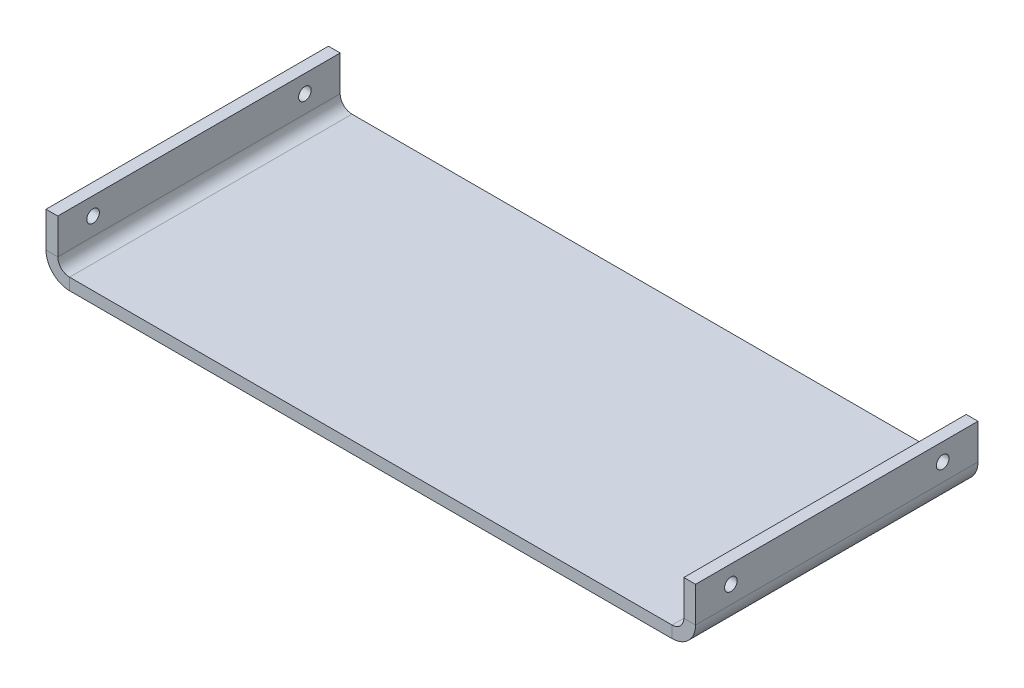
ISO-10303-21;
HEADER;
FILE_DESCRIPTION(('STEP AP214'),'2;1');
FILE_NAME('part.step','',(''),(''),'','','');
FILE_SCHEMA(('AUTOMOTIVE_DESIGN { 1 0 10303 214 1 1 1 1 }'));
ENDSEC;
DATA;
#1=APPLICATION_CONTEXT('core data for automotive mechanical design processes');
#2=APPLICATION_PROTOCOL_DEFINITION('international standard','automotive_design',2000,#1);
#3=PRODUCT_CONTEXT('',#1,'mechanical');
#4=PRODUCT('Part','Part','',(#3));
#5=PRODUCT_RELATED_PRODUCT_CATEGORY('part','',(#4));
#6=PRODUCT_DEFINITION_FORMATION('','',#4);
#7=PRODUCT_DEFINITION_CONTEXT('part definition',#1,'design');
#8=PRODUCT_DEFINITION('design','',#6,#7);
#9=PRODUCT_DEFINITION_SHAPE('','',#8);
#10=(LENGTH_UNIT() NAMED_UNIT(*) SI_UNIT(.MILLI.,.METRE.));
#11=(NAMED_UNIT(*) PLANE_ANGLE_UNIT() SI_UNIT($,.RADIAN.));
#12=(NAMED_UNIT(*) SI_UNIT($,.STERADIAN.) SOLID_ANGLE_UNIT());
#13=UNCERTAINTY_MEASURE_WITH_UNIT(LENGTH_MEASURE(1.E-05),#10,'distance_accuracy_value','');
#14=(GEOMETRIC_REPRESENTATION_CONTEXT(3) GLOBAL_UNCERTAINTY_ASSIGNED_CONTEXT((#13)) GLOBAL_UNIT_ASSIGNED_CONTEXT((#10,
#11,#12)) REPRESENTATION_CONTEXT('',''));
#15=CARTESIAN_POINT('',(0.,0.,0.));
#16=DIRECTION('',(0.,0.,1.));
#17=DIRECTION('',(1.,0.,0.));
#18=AXIS2_PLACEMENT_3D('',#15,#16,#17);
#19=CARTESIAN_POINT('',(0.,3.175,0.));
#20=DIRECTION('',(0.,-1.,0.));
#21=DIRECTION('',(0.,0.,-1.));
#22=AXIS2_PLACEMENT_3D('',#19,#20,#21);
#23=PLANE('',#22);
#24=DIRECTION('',(0.,0.,1.));
#25=VECTOR('',#24,1.);
#26=CARTESIAN_POINT('',(-81.28,3.17499999999999,38.1));
#27=LINE('',#26,#25);
#28=CARTESIAN_POINT('',(-81.28,3.17499999999999,38.1));
#29=VERTEX_POINT('',#28);
#30=CARTESIAN_POINT('',(-81.28,3.17499999999999,-38.1));
#31=VERTEX_POINT('',#30);
#32=EDGE_CURVE('E223',#29,#31,#27,.F.);
#33=ORIENTED_EDGE('',*,*,#32,.F.);
#34=DIRECTION('',(1.,0.,0.));
#35=VECTOR('',#34,1.);
#36=CARTESIAN_POINT('',(-87.63,3.175,38.1));
#37=LINE('',#36,#35);
#38=CARTESIAN_POINT('',(81.28,3.17499999999999,38.1));
#39=VERTEX_POINT('',#38);
#40=EDGE_CURVE('E13',#29,#39,#37,.T.);
#41=ORIENTED_EDGE('',*,*,#40,.T.);
#42=DIRECTION('',(0.,0.,-1.));
#43=VECTOR('',#42,1.);
#44=CARTESIAN_POINT('',(81.28,3.17499999999999,-38.1));
#45=LINE('',#44,#43);
#46=CARTESIAN_POINT('',(81.28,3.17499999999999,-38.1));
#47=VERTEX_POINT('',#46);
#48=EDGE_CURVE('E274',#47,#39,#45,.F.);
#49=ORIENTED_EDGE('',*,*,#48,.F.);
#50=DIRECTION('',(-1.,0.,0.));
#51=VECTOR('',#50,1.);
#52=CARTESIAN_POINT('',(-87.63,3.175,-38.1));
#53=LINE('',#52,#51);
#54=EDGE_CURVE('E88',#47,#31,#53,.T.);
#55=ORIENTED_EDGE('',*,*,#54,.T.);
#56=EDGE_LOOP('',(#33,#41,#49,#55));
#57=FACE_BOUND('',#56,.T.);
#58=ADVANCED_FACE('F79',(#57),#23,.F.);
#59=CARTESIAN_POINT('',(0.,0.,0.));
#60=DIRECTION('',(0.,-1.,0.));
#61=DIRECTION('',(0.,0.,-1.));
#62=AXIS2_PLACEMENT_3D('',#59,#60,#61);
#63=PLANE('',#62);
#64=DIRECTION('',(1.,0.,0.));
#65=VECTOR('',#64,1.);
#66=CARTESIAN_POINT('',(0.,0.,38.1));
#67=LINE('',#66,#65);
#68=CARTESIAN_POINT('',(-81.28,0.,38.1));
#69=VERTEX_POINT('',#68);
#70=CARTESIAN_POINT('',(81.28,0.,38.1));
#71=VERTEX_POINT('',#70);
#72=EDGE_CURVE('E284',#69,#71,#67,.T.);
#73=ORIENTED_EDGE('',*,*,#72,.F.);
#74=DIRECTION('',(0.,0.,1.));
#75=VECTOR('',#74,1.);
#76=CARTESIAN_POINT('',(-81.28,0.,38.1));
#77=LINE('',#76,#75);
#78=CARTESIAN_POINT('',(-81.28,0.,-38.1));
#79=VERTEX_POINT('',#78);
#80=EDGE_CURVE('E212',#69,#79,#77,.F.);
#81=ORIENTED_EDGE('',*,*,#80,.T.);
#82=DIRECTION('',(1.,0.,0.));
#83=VECTOR('',#82,1.);
#84=CARTESIAN_POINT('',(0.,0.,-38.1));
#85=LINE('',#84,#83);
#86=CARTESIAN_POINT('',(81.28,0.,-38.1));
#87=VERTEX_POINT('',#86);
#88=EDGE_CURVE('E280',#87,#79,#85,.F.);
#89=ORIENTED_EDGE('',*,*,#88,.F.);
#90=DIRECTION('',(0.,0.,-1.));
#91=VECTOR('',#90,1.);
#92=CARTESIAN_POINT('',(81.28,0.,-38.1));
#93=LINE('',#92,#91);
#94=EDGE_CURVE('E263',#87,#71,#93,.F.);
#95=ORIENTED_EDGE('',*,*,#94,.T.);
#96=EDGE_LOOP('',(#73,#81,#89,#95));
#97=FACE_BOUND('',#96,.T.);
#98=ADVANCED_FACE('F294',(#97),#63,.T.);
#99=CARTESIAN_POINT('',(-87.63,3.175,38.1));
#100=DIRECTION('',(0.,0.,-1.));
#101=DIRECTION('',(1.,0.,0.));
#102=AXIS2_PLACEMENT_3D('',#99,#100,#101);
#103=PLANE('',#102);
#104=ORIENTED_EDGE('',*,*,#40,.F.);
#105=DIRECTION('',(0.,-1.,0.));
#106=VECTOR('',#105,1.);
#107=CARTESIAN_POINT('',(-81.28,3.17499999999999,38.1));
#108=LINE('',#107,#106);
#109=EDGE_CURVE('E217',#29,#69,#108,.T.);
#110=ORIENTED_EDGE('',*,*,#109,.T.);
#111=ORIENTED_EDGE('',*,*,#72,.T.);
#112=DIRECTION('',(0.,-1.,0.));
#113=VECTOR('',#112,1.);
#114=CARTESIAN_POINT('',(81.28,3.17499999999999,38.1));
#115=LINE('',#114,#113);
#116=EDGE_CURVE('E278',#39,#71,#115,.T.);
#117=ORIENTED_EDGE('',*,*,#116,.F.);
#118=EDGE_LOOP('',(#104,#110,#111,#117));
#119=FACE_BOUND('',#118,.T.);
#120=ADVANCED_FACE('F302',(#119),#103,.F.);
#121=CARTESIAN_POINT('',(-87.63,3.175,-38.1));
#122=DIRECTION('',(0.,0.,1.));
#123=DIRECTION('',(-1.,0.,0.));
#124=AXIS2_PLACEMENT_3D('',#121,#122,#123);
#125=PLANE('',#124);
#126=DIRECTION('',(0.,-1.,0.));
#127=VECTOR('',#126,1.);
#128=CARTESIAN_POINT('',(-81.28,3.17499999999999,-38.1));
#129=LINE('',#128,#127);
#130=EDGE_CURVE('E228',#31,#79,#129,.T.);
#131=ORIENTED_EDGE('',*,*,#130,.F.);
#132=ORIENTED_EDGE('',*,*,#54,.F.);
#133=DIRECTION('',(0.,-1.,0.));
#134=VECTOR('',#133,1.);
#135=CARTESIAN_POINT('',(81.28,3.17499999999999,-38.1));
#136=LINE('',#135,#134);
#137=EDGE_CURVE('E268',#47,#87,#136,.T.);
#138=ORIENTED_EDGE('',*,*,#137,.T.);
#139=ORIENTED_EDGE('',*,*,#88,.T.);
#140=EDGE_LOOP('',(#131,#132,#138,#139));
#141=FACE_BOUND('',#140,.T.);
#142=ADVANCED_FACE('F81',(#141),#125,.F.);
#143=CARTESIAN_POINT('',(81.28,6.34999999999999,38.1));
#144=DIRECTION('',(0.,0.,1.));
#145=DIRECTION('',(1.,0.,0.));
#146=AXIS2_PLACEMENT_3D('',#143,#144,#145);
#147=PLANE('',#146);
#148=DIRECTION('',(-1.,0.,0.));
#149=VECTOR('',#148,1.);
#150=CARTESIAN_POINT('',(87.63,6.34999999999997,38.1));
#151=LINE('',#150,#149);
#152=CARTESIAN_POINT('',(84.455,6.34999999999998,38.1));
#153=VERTEX_POINT('',#152);
#154=CARTESIAN_POINT('',(87.63,6.34999999999997,38.1));
#155=VERTEX_POINT('',#154);
#156=EDGE_CURVE('E230',#153,#155,#151,.F.);
#157=ORIENTED_EDGE('',*,*,#156,.F.);
#158=CARTESIAN_POINT('',(81.28,6.34999999999999,38.1));
#159=DIRECTION('',(0.,0.,-1.));
#160=DIRECTION('',(-1.,0.,0.));
#161=AXIS2_PLACEMENT_3D('',#158,#159,#160);
#162=CIRCLE('',#161,3.175);
#163=EDGE_CURVE('E271',#39,#153,#162,.F.);
#164=ORIENTED_EDGE('',*,*,#163,.F.);
#165=ORIENTED_EDGE('',*,*,#116,.T.);
#166=CARTESIAN_POINT('',(81.28,6.34999999999999,38.1));
#167=DIRECTION('',(0.,0.,-1.));
#168=DIRECTION('',(-1.,0.,0.));
#169=AXIS2_PLACEMENT_3D('',#166,#167,#168);
#170=CIRCLE('',#169,6.35);
#171=EDGE_CURVE('E96',#71,#155,#170,.F.);
#172=ORIENTED_EDGE('',*,*,#171,.T.);
#173=EDGE_LOOP('',(#157,#164,#165,#172));
#174=FACE_BOUND('',#173,.T.);
#175=ADVANCED_FACE('F338',(#174),#147,.T.);
#176=CARTESIAN_POINT('',(81.28,6.34999999999999,-38.1));
#177=DIRECTION('',(0.,0.,1.));
#178=DIRECTION('',(1.,0.,0.));
#179=AXIS2_PLACEMENT_3D('',#176,#177,#178);
#180=PLANE('',#179);
#181=CARTESIAN_POINT('',(81.28,6.34999999999999,-38.1));
#182=DIRECTION('',(0.,0.,-1.));
#183=DIRECTION('',(-1.,0.,0.));
#184=AXIS2_PLACEMENT_3D('',#181,#182,#183);
#185=CIRCLE('',#184,3.175);
#186=CARTESIAN_POINT('',(84.455,6.34999999999998,-38.1));
#187=VERTEX_POINT('',#186);
#188=EDGE_CURVE('E236',#187,#47,#185,.T.);
#189=ORIENTED_EDGE('',*,*,#188,.F.);
#190=DIRECTION('',(-1.,0.,0.));
#191=VECTOR('',#190,1.);
#192=CARTESIAN_POINT('',(84.455,6.34999999999998,-38.1));
#193=LINE('',#192,#191);
#194=CARTESIAN_POINT('',(87.63,6.34999999999997,-38.1));
#195=VERTEX_POINT('',#194);
#196=EDGE_CURVE('E256',#187,#195,#193,.F.);
#197=ORIENTED_EDGE('',*,*,#196,.T.);
#198=CARTESIAN_POINT('',(81.28,6.34999999999999,-38.1));
#199=DIRECTION('',(0.,0.,-1.));
#200=DIRECTION('',(-1.,0.,0.));
#201=AXIS2_PLACEMENT_3D('',#198,#199,#200);
#202=CIRCLE('',#201,6.35);
#203=EDGE_CURVE('E266',#195,#87,#202,.T.);
#204=ORIENTED_EDGE('',*,*,#203,.T.);
#205=ORIENTED_EDGE('',*,*,#137,.F.);
#206=EDGE_LOOP('',(#189,#197,#204,#205));
#207=FACE_BOUND('',#206,.T.);
#208=ADVANCED_FACE('F332',(#207),#180,.F.);
#209=CARTESIAN_POINT('',(81.28,6.34999999999999,-38.1));
#210=DIRECTION('',(0.,0.,-1.));
#211=DIRECTION('',(1.,0.,0.));
#212=AXIS2_PLACEMENT_3D('',#209,#210,#211);
#213=CYLINDRICAL_SURFACE('',#212,6.35);
#214=ORIENTED_EDGE('',*,*,#94,.F.);
#215=ORIENTED_EDGE('',*,*,#203,.F.);
#216=DIRECTION('',(0.,0.,-1.));
#217=VECTOR('',#216,1.);
#218=CARTESIAN_POINT('',(87.63,6.34999999999997,38.1));
#219=LINE('',#218,#217);
#220=EDGE_CURVE('E254',#195,#155,#219,.F.);
#221=ORIENTED_EDGE('',*,*,#220,.T.);
#222=ORIENTED_EDGE('',*,*,#171,.F.);
#223=EDGE_LOOP('',(#214,#215,#221,#222));
#224=FACE_BOUND('',#223,.T.);
#225=ADVANCED_FACE('F346',(#224),#213,.T.);
#226=CARTESIAN_POINT('',(81.28,6.34999999999999,-38.1));
#227=DIRECTION('',(0.,0.,-1.));
#228=DIRECTION('',(1.,0.,0.));
#229=AXIS2_PLACEMENT_3D('',#226,#227,#228);
#230=CYLINDRICAL_SURFACE('',#229,3.175);
#231=ORIENTED_EDGE('',*,*,#48,.T.);
#232=ORIENTED_EDGE('',*,*,#163,.T.);
#233=DIRECTION('',(0.,0.,-1.));
#234=VECTOR('',#233,1.);
#235=CARTESIAN_POINT('',(84.455,6.34999999999998,38.1));
#236=LINE('',#235,#234);
#237=EDGE_CURVE('E259',#153,#187,#236,.T.);
#238=ORIENTED_EDGE('',*,*,#237,.T.);
#239=ORIENTED_EDGE('',*,*,#188,.T.);
#240=EDGE_LOOP('',(#231,#232,#238,#239));
#241=FACE_BOUND('',#240,.T.);
#242=ADVANCED_FACE('F349',(#241),#230,.F.);
#243=CARTESIAN_POINT('',(87.63,15.875,-38.1));
#244=DIRECTION('',(0.,0.,1.));
#245=DIRECTION('',(1.,0.,0.));
#246=AXIS2_PLACEMENT_3D('',#243,#244,#245);
#247=PLANE('',#246);
#248=ORIENTED_EDGE('',*,*,#196,.F.);
#249=DIRECTION('',(0.,-1.,0.));
#250=VECTOR('',#249,1.);
#251=CARTESIAN_POINT('',(84.455,15.875,-38.1));
#252=LINE('',#251,#250);
#253=CARTESIAN_POINT('',(84.455,15.875,-38.1));
#254=VERTEX_POINT('',#253);
#255=EDGE_CURVE('E252',#187,#254,#252,.F.);
#256=ORIENTED_EDGE('',*,*,#255,.T.);
#257=DIRECTION('',(-1.,0.,0.));
#258=VECTOR('',#257,1.);
#259=CARTESIAN_POINT('',(87.63,15.875,-38.1));
#260=LINE('',#259,#258);
#261=CARTESIAN_POINT('',(87.63,15.875,-38.1));
#262=VERTEX_POINT('',#261);
#263=EDGE_CURVE('E233',#262,#254,#260,.T.);
#264=ORIENTED_EDGE('',*,*,#263,.F.);
#265=DIRECTION('',(0.,1.,0.));
#266=VECTOR('',#265,1.);
#267=CARTESIAN_POINT('',(87.63,-2.98355660872586E-13,-38.1));
#268=LINE('',#267,#266);
#269=EDGE_CURVE('E245',#195,#262,#268,.T.);
#270=ORIENTED_EDGE('',*,*,#269,.F.);
#271=EDGE_LOOP('',(#248,#256,#264,#270));
#272=FACE_BOUND('',#271,.T.);
#273=ADVANCED_FACE('F352',(#272),#247,.F.);
#274=CARTESIAN_POINT('',(87.63,3.17499999999999,38.1));
#275=DIRECTION('',(0.,0.,-1.));
#276=DIRECTION('',(-1.,0.,0.));
#277=AXIS2_PLACEMENT_3D('',#274,#275,#276);
#278=PLANE('',#277);
#279=ORIENTED_EDGE('',*,*,#156,.T.);
#280=DIRECTION('',(0.,-1.,0.));
#281=VECTOR('',#280,1.);
#282=CARTESIAN_POINT('',(87.63,-2.98355660872586E-13,38.1));
#283=LINE('',#282,#281);
#284=CARTESIAN_POINT('',(87.63,15.875,38.1));
#285=VERTEX_POINT('',#284);
#286=EDGE_CURVE('E240',#285,#155,#283,.T.);
#287=ORIENTED_EDGE('',*,*,#286,.F.);
#288=DIRECTION('',(-1.,0.,0.));
#289=VECTOR('',#288,1.);
#290=CARTESIAN_POINT('',(87.63,15.875,38.1));
#291=LINE('',#290,#289);
#292=CARTESIAN_POINT('',(84.455,15.875,38.1));
#293=VERTEX_POINT('',#292);
#294=EDGE_CURVE('E237',#285,#293,#291,.T.);
#295=ORIENTED_EDGE('',*,*,#294,.T.);
#296=DIRECTION('',(0.,1.,0.));
#297=VECTOR('',#296,1.);
#298=CARTESIAN_POINT('',(84.455,3.175,38.1));
#299=LINE('',#298,#297);
#300=EDGE_CURVE('E247',#293,#153,#299,.F.);
#301=ORIENTED_EDGE('',*,*,#300,.T.);
#302=EDGE_LOOP('',(#279,#287,#295,#301));
#303=FACE_BOUND('',#302,.T.);
#304=ADVANCED_FACE('F357',(#303),#278,.F.);
#305=CARTESIAN_POINT('',(87.63,-2.98355660872586E-13,0.));
#306=DIRECTION('',(-1.,0.,0.));
#307=DIRECTION('',(0.,-1.,0.));
#308=AXIS2_PLACEMENT_3D('',#305,#306,#307);
#309=PLANE('',#308);
#310=CARTESIAN_POINT('',(87.6300000000001,11.1125,-28.575));
#311=DIRECTION('',(-1.,0.,0.));
#312=DIRECTION('',(0.,0.,1.));
#313=AXIS2_PLACEMENT_3D('',#310,#311,#312);
#314=CIRCLE('',#313,1.69999999999996);
#315=CARTESIAN_POINT('',(87.6300000000001,11.1125,-26.875));
#316=VERTEX_POINT('',#315);
#317=EDGE_CURVE('E374',#316,#316,#314,.T.);
#318=ORIENTED_EDGE('',*,*,#317,.T.);
#319=EDGE_LOOP('',(#318));
#320=FACE_BOUND('',#319,.T.);
#321=CARTESIAN_POINT('',(87.6300000000001,11.1125,28.575));
#322=DIRECTION('',(-1.,0.,0.));
#323=DIRECTION('',(0.,0.,1.));
#324=AXIS2_PLACEMENT_3D('',#321,#322,#323);
#325=CIRCLE('',#324,1.69999999999996);
#326=CARTESIAN_POINT('',(87.6300000000001,11.1125,30.275));
#327=VERTEX_POINT('',#326);
#328=EDGE_CURVE('E378',#327,#327,#325,.T.);
#329=ORIENTED_EDGE('',*,*,#328,.T.);
#330=EDGE_LOOP('',(#329));
#331=FACE_BOUND('',#330,.T.);
#332=ORIENTED_EDGE('',*,*,#220,.F.);
#333=ORIENTED_EDGE('',*,*,#269,.T.);
#334=DIRECTION('',(0.,0.,1.));
#335=VECTOR('',#334,1.);
#336=CARTESIAN_POINT('',(87.63,15.875,0.));
#337=LINE('',#336,#335);
#338=EDGE_CURVE('E243',#262,#285,#337,.T.);
#339=ORIENTED_EDGE('',*,*,#338,.T.);
#340=ORIENTED_EDGE('',*,*,#286,.T.);
#341=EDGE_LOOP('',(#332,#333,#339,#340));
#342=FACE_BOUND('',#341,.T.);
#343=ADVANCED_FACE('F362',(#320,#331,#342),#309,.F.);
#344=CARTESIAN_POINT('',(84.455,-2.87270207621759E-13,0.));
#345=DIRECTION('',(-1.,0.,0.));
#346=DIRECTION('',(0.,-1.,0.));
#347=AXIS2_PLACEMENT_3D('',#344,#345,#346);
#348=PLANE('',#347);
#349=CARTESIAN_POINT('',(84.455,11.1125,-28.575));
#350=DIRECTION('',(-1.,0.,0.));
#351=DIRECTION('',(0.,-1.,0.));
#352=AXIS2_PLACEMENT_3D('',#349,#350,#351);
#353=CIRCLE('',#352,1.69999999999997);
#354=CARTESIAN_POINT('',(84.455,9.41250000000002,-28.575));
#355=VERTEX_POINT('',#354);
#356=EDGE_CURVE('E400',#355,#355,#353,.T.);
#357=ORIENTED_EDGE('',*,*,#356,.F.);
#358=EDGE_LOOP('',(#357));
#359=FACE_BOUND('',#358,.T.);
#360=CARTESIAN_POINT('',(84.455,11.1125,28.575));
#361=DIRECTION('',(-1.,0.,0.));
#362=DIRECTION('',(0.,-1.,0.));
#363=AXIS2_PLACEMENT_3D('',#360,#361,#362);
#364=CIRCLE('',#363,1.69999999999997);
#365=CARTESIAN_POINT('',(84.455,9.41250000000002,28.575));
#366=VERTEX_POINT('',#365);
#367=EDGE_CURVE('E211',#366,#366,#364,.T.);
#368=ORIENTED_EDGE('',*,*,#367,.F.);
#369=EDGE_LOOP('',(#368));
#370=FACE_BOUND('',#369,.T.);
#371=ORIENTED_EDGE('',*,*,#255,.F.);
#372=ORIENTED_EDGE('',*,*,#237,.F.);
#373=ORIENTED_EDGE('',*,*,#300,.F.);
#374=DIRECTION('',(0.,0.,-1.));
#375=VECTOR('',#374,1.);
#376=CARTESIAN_POINT('',(84.455,15.875,38.1));
#377=LINE('',#376,#375);
#378=EDGE_CURVE('E250',#254,#293,#377,.F.);
#379=ORIENTED_EDGE('',*,*,#378,.F.);
#380=EDGE_LOOP('',(#371,#372,#373,#379));
#381=FACE_BOUND('',#380,.T.);
#382=ADVANCED_FACE('F321',(#359,#370,#381),#348,.T.);
#383=CARTESIAN_POINT('',(87.63,15.875,38.1));
#384=DIRECTION('',(0.,-1.,0.));
#385=DIRECTION('',(1.,0.,0.));
#386=AXIS2_PLACEMENT_3D('',#383,#384,#385);
#387=PLANE('',#386);
#388=ORIENTED_EDGE('',*,*,#378,.T.);
#389=ORIENTED_EDGE('',*,*,#294,.F.);
#390=ORIENTED_EDGE('',*,*,#338,.F.);
#391=ORIENTED_EDGE('',*,*,#263,.T.);
#392=EDGE_LOOP('',(#388,#389,#390,#391));
#393=FACE_BOUND('',#392,.T.);
#394=ADVANCED_FACE('F314',(#393),#387,.F.);
#395=CARTESIAN_POINT('',(-81.28,6.34999999999999,-38.1));
#396=DIRECTION('',(0.,0.,-1.));
#397=DIRECTION('',(-1.,0.,0.));
#398=AXIS2_PLACEMENT_3D('',#395,#396,#397);
#399=PLANE('',#398);
#400=DIRECTION('',(1.,0.,0.));
#401=VECTOR('',#400,1.);
#402=CARTESIAN_POINT('',(-87.63,6.34999999999997,-38.1));
#403=LINE('',#402,#401);
#404=CARTESIAN_POINT('',(-84.455,6.34999999999998,-38.1));
#405=VERTEX_POINT('',#404);
#406=CARTESIAN_POINT('',(-87.63,6.34999999999997,-38.1));
#407=VERTEX_POINT('',#406);
#408=EDGE_CURVE('E194',#405,#407,#403,.F.);
#409=ORIENTED_EDGE('',*,*,#408,.F.);
#410=CARTESIAN_POINT('',(-81.28,6.34999999999999,-38.1));
#411=DIRECTION('',(0.,0.,1.));
#412=DIRECTION('',(1.,0.,0.));
#413=AXIS2_PLACEMENT_3D('',#410,#411,#412);
#414=CIRCLE('',#413,3.175);
#415=EDGE_CURVE('E220',#31,#405,#414,.F.);
#416=ORIENTED_EDGE('',*,*,#415,.F.);
#417=ORIENTED_EDGE('',*,*,#130,.T.);
#418=CARTESIAN_POINT('',(-81.28,6.34999999999999,-38.1));
#419=DIRECTION('',(0.,0.,1.));
#420=DIRECTION('',(1.,0.,0.));
#421=AXIS2_PLACEMENT_3D('',#418,#419,#420);
#422=CIRCLE('',#421,6.35);
#423=EDGE_CURVE('E104',#79,#407,#422,.F.);
#424=ORIENTED_EDGE('',*,*,#423,.T.);
#425=EDGE_LOOP('',(#409,#416,#417,#424));
#426=FACE_BOUND('',#425,.T.);
#427=ADVANCED_FACE('F312',(#426),#399,.T.);
#428=CARTESIAN_POINT('',(-81.28,6.34999999999999,38.1));
#429=DIRECTION('',(0.,0.,-1.));
#430=DIRECTION('',(-1.,0.,0.));
#431=AXIS2_PLACEMENT_3D('',#428,#429,#430);
#432=PLANE('',#431);
#433=CARTESIAN_POINT('',(-81.28,6.34999999999999,38.1));
#434=DIRECTION('',(0.,0.,1.));
#435=DIRECTION('',(1.,0.,0.));
#436=AXIS2_PLACEMENT_3D('',#433,#434,#435);
#437=CIRCLE('',#436,3.175);
#438=CARTESIAN_POINT('',(-84.455,6.34999999999998,38.1));
#439=VERTEX_POINT('',#438);
#440=EDGE_CURVE('E225',#439,#29,#437,.T.);
#441=ORIENTED_EDGE('',*,*,#440,.F.);
#442=DIRECTION('',(1.,0.,0.));
#443=VECTOR('',#442,1.);
#444=CARTESIAN_POINT('',(-84.455,6.34999999999998,38.1));
#445=LINE('',#444,#443);
#446=CARTESIAN_POINT('',(-87.63,6.34999999999997,38.1));
#447=VERTEX_POINT('',#446);
#448=EDGE_CURVE('E205',#439,#447,#445,.F.);
#449=ORIENTED_EDGE('',*,*,#448,.T.);
#450=CARTESIAN_POINT('',(-81.28,6.34999999999999,38.1));
#451=DIRECTION('',(0.,0.,1.));
#452=DIRECTION('',(1.,0.,0.));
#453=AXIS2_PLACEMENT_3D('',#450,#451,#452);
#454=CIRCLE('',#453,6.35);
#455=EDGE_CURVE('E215',#447,#69,#454,.T.);
#456=ORIENTED_EDGE('',*,*,#455,.T.);
#457=ORIENTED_EDGE('',*,*,#109,.F.);
#458=EDGE_LOOP('',(#441,#449,#456,#457));
#459=FACE_BOUND('',#458,.T.);
#460=ADVANCED_FACE('F298',(#459),#432,.F.);
#461=CARTESIAN_POINT('',(-81.28,6.34999999999999,38.1));
#462=DIRECTION('',(0.,0.,1.));
#463=DIRECTION('',(-1.,0.,0.));
#464=AXIS2_PLACEMENT_3D('',#461,#462,#463);
#465=CYLINDRICAL_SURFACE('',#464,6.35);
#466=ORIENTED_EDGE('',*,*,#80,.F.);
#467=ORIENTED_EDGE('',*,*,#455,.F.);
#468=DIRECTION('',(0.,0.,1.));
#469=VECTOR('',#468,1.);
#470=CARTESIAN_POINT('',(-87.63,6.34999999999997,-38.1));
#471=LINE('',#470,#469);
#472=EDGE_CURVE('E203',#447,#407,#471,.F.);
#473=ORIENTED_EDGE('',*,*,#472,.T.);
#474=ORIENTED_EDGE('',*,*,#423,.F.);
#475=EDGE_LOOP('',(#466,#467,#473,#474));
#476=FACE_BOUND('',#475,.T.);
#477=ADVANCED_FACE('F295',(#476),#465,.T.);
#478=CARTESIAN_POINT('',(-81.28,6.34999999999999,38.1));
#479=DIRECTION('',(0.,0.,1.));
#480=DIRECTION('',(-1.,0.,0.));
#481=AXIS2_PLACEMENT_3D('',#478,#479,#480);
#482=CYLINDRICAL_SURFACE('',#481,3.175);
#483=ORIENTED_EDGE('',*,*,#32,.T.);
#484=ORIENTED_EDGE('',*,*,#415,.T.);
#485=DIRECTION('',(0.,0.,1.));
#486=VECTOR('',#485,1.);
#487=CARTESIAN_POINT('',(-84.455,6.34999999999998,-38.1));
#488=LINE('',#487,#486);
#489=EDGE_CURVE('E208',#405,#439,#488,.T.);
#490=ORIENTED_EDGE('',*,*,#489,.T.);
#491=ORIENTED_EDGE('',*,*,#440,.T.);
#492=EDGE_LOOP('',(#483,#484,#490,#491));
#493=FACE_BOUND('',#492,.T.);
#494=ADVANCED_FACE('F309',(#493),#482,.F.);
#495=CARTESIAN_POINT('',(-87.63,3.17499999999999,-38.1));
#496=DIRECTION('',(0.,0.,1.));
#497=DIRECTION('',(1.,0.,0.));
#498=AXIS2_PLACEMENT_3D('',#495,#496,#497);
#499=PLANE('',#498);
#500=ORIENTED_EDGE('',*,*,#408,.T.);
#501=DIRECTION('',(0.,-1.,0.));
#502=VECTOR('',#501,1.);
#503=CARTESIAN_POINT('',(-87.63,-2.98355660872586E-13,-38.1));
#504=LINE('',#503,#502);
#505=CARTESIAN_POINT('',(-87.63,15.875,-38.1));
#506=VERTEX_POINT('',#505);
#507=EDGE_CURVE('E175',#506,#407,#504,.T.);
#508=ORIENTED_EDGE('',*,*,#507,.F.);
#509=DIRECTION('',(1.,0.,0.));
#510=VECTOR('',#509,1.);
#511=CARTESIAN_POINT('',(-87.63,15.875,-38.1));
#512=LINE('',#511,#510);
#513=CARTESIAN_POINT('',(-84.455,15.875,-38.1));
#514=VERTEX_POINT('',#513);
#515=EDGE_CURVE('E181',#506,#514,#512,.T.);
#516=ORIENTED_EDGE('',*,*,#515,.T.);
#517=DIRECTION('',(0.,1.,0.));
#518=VECTOR('',#517,1.);
#519=CARTESIAN_POINT('',(-84.455,3.175,-38.1));
#520=LINE('',#519,#518);
#521=EDGE_CURVE('E201',#514,#405,#520,.F.);
#522=ORIENTED_EDGE('',*,*,#521,.T.);
#523=EDGE_LOOP('',(#500,#508,#516,#522));
#524=FACE_BOUND('',#523,.T.);
#525=ADVANCED_FACE('F193',(#524),#499,.F.);
#526=CARTESIAN_POINT('',(-87.63,15.875,38.1));
#527=DIRECTION('',(0.,0.,-1.));
#528=DIRECTION('',(-1.,0.,0.));
#529=AXIS2_PLACEMENT_3D('',#526,#527,#528);
#530=PLANE('',#529);
#531=ORIENTED_EDGE('',*,*,#448,.F.);
#532=DIRECTION('',(0.,-1.,0.));
#533=VECTOR('',#532,1.);
#534=CARTESIAN_POINT('',(-84.455,15.875,38.1));
#535=LINE('',#534,#533);
#536=CARTESIAN_POINT('',(-84.455,15.875,38.1));
#537=VERTEX_POINT('',#536);
#538=EDGE_CURVE('E197',#439,#537,#535,.F.);
#539=ORIENTED_EDGE('',*,*,#538,.T.);
#540=DIRECTION('',(1.,0.,0.));
#541=VECTOR('',#540,1.);
#542=CARTESIAN_POINT('',(-87.63,15.875,38.1));
#543=LINE('',#542,#541);
#544=CARTESIAN_POINT('',(-87.63,15.875,38.1));
#545=VERTEX_POINT('',#544);
#546=EDGE_CURVE('E190',#545,#537,#543,.T.);
#547=ORIENTED_EDGE('',*,*,#546,.F.);
#548=DIRECTION('',(0.,1.,0.));
#549=VECTOR('',#548,1.);
#550=CARTESIAN_POINT('',(-87.63,-2.98355660872586E-13,38.1));
#551=LINE('',#550,#549);
#552=EDGE_CURVE('E177',#447,#545,#551,.T.);
#553=ORIENTED_EDGE('',*,*,#552,.F.);
#554=EDGE_LOOP('',(#531,#539,#547,#553));
#555=FACE_BOUND('',#554,.T.);
#556=ADVANCED_FACE('F410',(#555),#530,.F.);
#557=CARTESIAN_POINT('',(-87.63,-2.98355660872586E-13,0.));
#558=DIRECTION('',(1.,0.,0.));
#559=DIRECTION('',(0.,1.,0.));
#560=AXIS2_PLACEMENT_3D('',#557,#558,#559);
#561=PLANE('',#560);
#562=CARTESIAN_POINT('',(-87.63,11.1125,-28.575));
#563=DIRECTION('',(-1.,0.,0.));
#564=DIRECTION('',(0.,0.,1.));
#565=AXIS2_PLACEMENT_3D('',#562,#563,#564);
#566=CIRCLE('',#565,1.69999999999998);
#567=CARTESIAN_POINT('',(-87.63,11.1125,-26.875));
#568=VERTEX_POINT('',#567);
#569=EDGE_CURVE('E522',#568,#568,#566,.T.);
#570=ORIENTED_EDGE('',*,*,#569,.F.);
#571=EDGE_LOOP('',(#570));
#572=FACE_BOUND('',#571,.T.);
#573=CARTESIAN_POINT('',(-87.63,11.1125,28.575));
#574=DIRECTION('',(-1.,0.,0.));
#575=DIRECTION('',(0.,0.,1.));
#576=AXIS2_PLACEMENT_3D('',#573,#574,#575);
#577=CIRCLE('',#576,1.69999999999998);
#578=CARTESIAN_POINT('',(-87.63,11.1125,30.275));
#579=VERTEX_POINT('',#578);
#580=EDGE_CURVE('E395',#579,#579,#577,.T.);
#581=ORIENTED_EDGE('',*,*,#580,.F.);
#582=EDGE_LOOP('',(#581));
#583=FACE_BOUND('',#582,.T.);
#584=ORIENTED_EDGE('',*,*,#472,.F.);
#585=ORIENTED_EDGE('',*,*,#552,.T.);
#586=DIRECTION('',(0.,0.,-1.));
#587=VECTOR('',#586,1.);
#588=CARTESIAN_POINT('',(-87.63,15.875,0.));
#589=LINE('',#588,#587);
#590=EDGE_CURVE('E170',#545,#506,#589,.T.);
#591=ORIENTED_EDGE('',*,*,#590,.T.);
#592=ORIENTED_EDGE('',*,*,#507,.T.);
#593=EDGE_LOOP('',(#584,#585,#591,#592));
#594=FACE_BOUND('',#593,.T.);
#595=ADVANCED_FACE('F173',(#572,#583,#594),#561,.F.);
#596=CARTESIAN_POINT('',(-84.455,-2.87270207621759E-13,0.));
#597=DIRECTION('',(1.,0.,0.));
#598=DIRECTION('',(0.,1.,0.));
#599=AXIS2_PLACEMENT_3D('',#596,#597,#598);
#600=PLANE('',#599);
#601=CARTESIAN_POINT('',(-84.455,11.1125,-28.575));
#602=DIRECTION('',(1.,0.,0.));
#603=DIRECTION('',(0.,1.,0.));
#604=AXIS2_PLACEMENT_3D('',#601,#602,#603);
#605=CIRCLE('',#604,1.69999999999997);
#606=CARTESIAN_POINT('',(-84.455,12.8125,-28.575));
#607=VERTEX_POINT('',#606);
#608=EDGE_CURVE('E83',#607,#607,#605,.T.);
#609=ORIENTED_EDGE('',*,*,#608,.F.);
#610=EDGE_LOOP('',(#609));
#611=FACE_BOUND('',#610,.T.);
#612=CARTESIAN_POINT('',(-84.455,11.1125,28.575));
#613=DIRECTION('',(1.,0.,0.));
#614=DIRECTION('',(0.,1.,0.));
#615=AXIS2_PLACEMENT_3D('',#612,#613,#614);
#616=CIRCLE('',#615,1.69999999999997);
#617=CARTESIAN_POINT('',(-84.455,12.8125,28.575));
#618=VERTEX_POINT('',#617);
#619=EDGE_CURVE('E394',#618,#618,#616,.T.);
#620=ORIENTED_EDGE('',*,*,#619,.F.);
#621=EDGE_LOOP('',(#620));
#622=FACE_BOUND('',#621,.T.);
#623=ORIENTED_EDGE('',*,*,#538,.F.);
#624=ORIENTED_EDGE('',*,*,#489,.F.);
#625=ORIENTED_EDGE('',*,*,#521,.F.);
#626=DIRECTION('',(0.,0.,1.));
#627=VECTOR('',#626,1.);
#628=CARTESIAN_POINT('',(-84.455,15.875,-38.1));
#629=LINE('',#628,#627);
#630=EDGE_CURVE('E186',#537,#514,#629,.F.);
#631=ORIENTED_EDGE('',*,*,#630,.F.);
#632=EDGE_LOOP('',(#623,#624,#625,#631));
#633=FACE_BOUND('',#632,.T.);
#634=ADVANCED_FACE('F409',(#611,#622,#633),#600,.T.);
#635=CARTESIAN_POINT('',(-87.63,15.875,-38.1));
#636=DIRECTION('',(0.,-1.,0.));
#637=DIRECTION('',(1.,0.,0.));
#638=AXIS2_PLACEMENT_3D('',#635,#636,#637);
#639=PLANE('',#638);
#640=ORIENTED_EDGE('',*,*,#630,.T.);
#641=ORIENTED_EDGE('',*,*,#515,.F.);
#642=ORIENTED_EDGE('',*,*,#590,.F.);
#643=ORIENTED_EDGE('',*,*,#546,.T.);
#644=EDGE_LOOP('',(#640,#641,#642,#643));
#645=FACE_BOUND('',#644,.T.);
#646=ADVANCED_FACE('F184',(#645),#639,.F.);
#647=CARTESIAN_POINT('',(-87.63,11.1125,28.575));
#648=DIRECTION('',(-1.,0.,0.));
#649=DIRECTION('',(0.,0.,1.));
#650=AXIS2_PLACEMENT_3D('',#647,#648,#649);
#651=CYLINDRICAL_SURFACE('',#650,1.69999999999997);
#652=ORIENTED_EDGE('',*,*,#619,.T.);
#653=EDGE_LOOP('',(#652));
#654=FACE_BOUND('',#653,.T.);
#655=ORIENTED_EDGE('',*,*,#580,.T.);
#656=EDGE_LOOP('',(#655));
#657=FACE_BOUND('',#656,.T.);
#658=ADVANCED_FACE('F448',(#654,#657),#651,.F.);
#659=ORIENTED_EDGE('',*,*,#367,.T.);
#660=EDGE_LOOP('',(#659));
#661=FACE_BOUND('',#660,.T.);
#662=ORIENTED_EDGE('',*,*,#328,.F.);
#663=EDGE_LOOP('',(#662));
#664=FACE_BOUND('',#663,.T.);
#665=ADVANCED_FACE('F487',(#661,#664),#651,.F.);
#666=CARTESIAN_POINT('',(-87.63,11.1125,-28.575));
#667=DIRECTION('',(-1.,0.,0.));
#668=DIRECTION('',(0.,0.,1.));
#669=AXIS2_PLACEMENT_3D('',#666,#667,#668);
#670=CYLINDRICAL_SURFACE('',#669,1.69999999999997);
#671=ORIENTED_EDGE('',*,*,#608,.T.);
#672=EDGE_LOOP('',(#671));
#673=FACE_BOUND('',#672,.T.);
#674=ORIENTED_EDGE('',*,*,#569,.T.);
#675=EDGE_LOOP('',(#674));
#676=FACE_BOUND('',#675,.T.);
#677=ADVANCED_FACE('F497',(#673,#676),#670,.F.);
#678=ORIENTED_EDGE('',*,*,#356,.T.);
#679=EDGE_LOOP('',(#678));
#680=FACE_BOUND('',#679,.T.);
#681=ORIENTED_EDGE('',*,*,#317,.F.);
#682=EDGE_LOOP('',(#681));
#683=FACE_BOUND('',#682,.T.);
#684=ADVANCED_FACE('F506',(#680,#683),#670,.F.);
#685=CLOSED_SHELL('',(#58,#98,#120,#142,#175,#208,#225,#242,#273,#304,#343,#382,#394,#427,#460,
#477,#494,#525,#556,#595,#634,#646,#658,#665,#677,#684));
#686=MANIFOLD_SOLID_BREP('B2',#685);
#687=ADVANCED_BREP_SHAPE_REPRESENTATION('',(#18,#686),#14);
#688=SHAPE_DEFINITION_REPRESENTATION(#9,#687);
ENDSEC;
END-ISO-10303-21;
